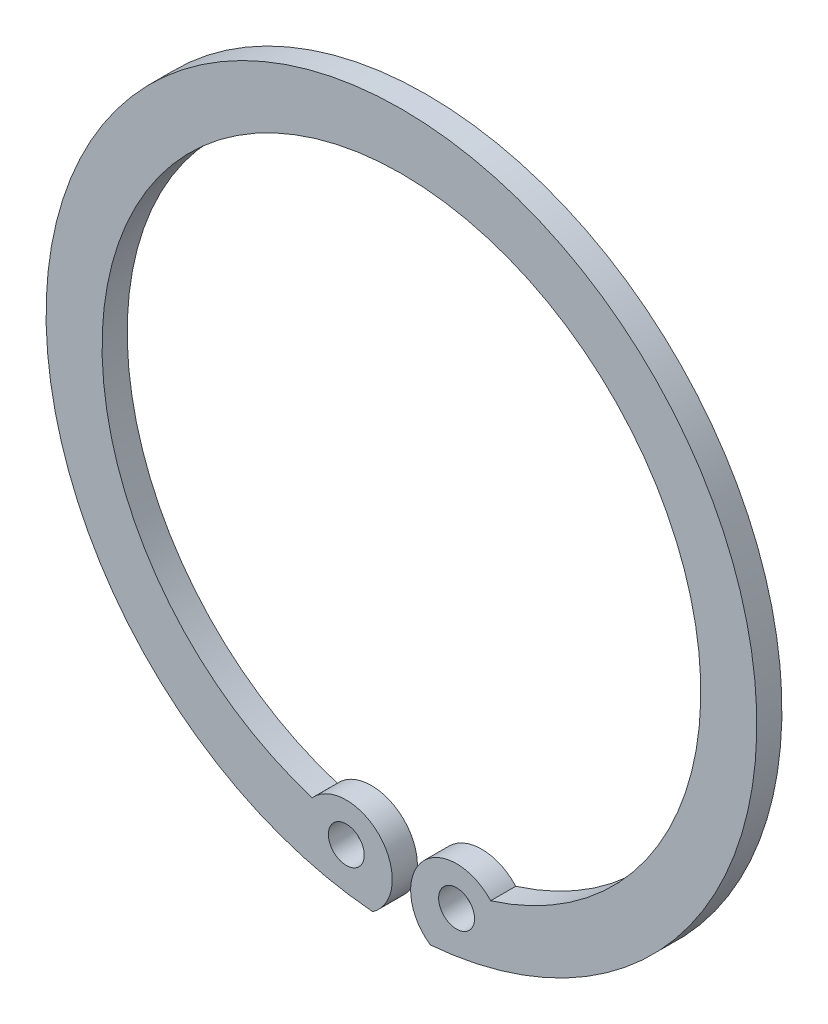
ISO-10303-21;
HEADER;
FILE_DESCRIPTION(('STEP AP214'),'2;1');
FILE_NAME('part.step','',(''),(''),'','','');
FILE_SCHEMA(('AUTOMOTIVE_DESIGN { 1 0 10303 214 1 1 1 1 }'));
ENDSEC;
DATA;
#1=APPLICATION_CONTEXT('core data for automotive mechanical design processes');
#2=APPLICATION_PROTOCOL_DEFINITION('international standard','automotive_design',2000,#1);
#3=PRODUCT_CONTEXT('',#1,'mechanical');
#4=PRODUCT('Part','Part','',(#3));
#5=PRODUCT_RELATED_PRODUCT_CATEGORY('part','',(#4));
#6=PRODUCT_DEFINITION_FORMATION('','',#4);
#7=PRODUCT_DEFINITION_CONTEXT('part definition',#1,'design');
#8=PRODUCT_DEFINITION('design','',#6,#7);
#9=PRODUCT_DEFINITION_SHAPE('','',#8);
#10=(LENGTH_UNIT() NAMED_UNIT(*) SI_UNIT(.MILLI.,.METRE.));
#11=(NAMED_UNIT(*) PLANE_ANGLE_UNIT() SI_UNIT($,.RADIAN.));
#12=(NAMED_UNIT(*) SI_UNIT($,.STERADIAN.) SOLID_ANGLE_UNIT());
#13=UNCERTAINTY_MEASURE_WITH_UNIT(LENGTH_MEASURE(1.E-05),#10,'distance_accuracy_value','');
#14=(GEOMETRIC_REPRESENTATION_CONTEXT(3) GLOBAL_UNCERTAINTY_ASSIGNED_CONTEXT((#13)) GLOBAL_UNIT_ASSIGNED_CONTEXT((#10,
#11,#12)) REPRESENTATION_CONTEXT('',''));
#15=CARTESIAN_POINT('',(0.,0.,0.));
#16=DIRECTION('',(0.,0.,1.));
#17=DIRECTION('',(1.,0.,0.));
#18=AXIS2_PLACEMENT_3D('',#15,#16,#17);
#19=CARTESIAN_POINT('',(0.,0.,1.75));
#20=DIRECTION('',(0.,0.,1.));
#21=DIRECTION('',(1.,0.,0.));
#22=AXIS2_PLACEMENT_3D('',#19,#20,#21);
#23=PLANE('',#22);
#24=CARTESIAN_POINT('',(0.,0.,1.75));
#25=DIRECTION('',(0.,0.,-1.));
#26=DIRECTION('',(1.,0.,0.));
#27=AXIS2_PLACEMENT_3D('',#24,#25,#26);
#28=CIRCLE('',#27,20.85);
#29=CARTESIAN_POINT('',(-6.21273201526708,-19.9028756943934,1.75));
#30=VERTEX_POINT('',#29);
#31=CARTESIAN_POINT('',(6.21273201526708,-19.9028756943934,1.75));
#32=VERTEX_POINT('',#31);
#33=EDGE_CURVE('E98',#30,#32,#28,.T.);
#34=ORIENTED_EDGE('',*,*,#33,.T.);
#35=CARTESIAN_POINT('',(3.84,-22.05,1.75));
#36=DIRECTION('',(0.,0.,1.));
#37=DIRECTION('',(-1.,0.,0.));
#38=AXIS2_PLACEMENT_3D('',#35,#36,#37);
#39=CIRCLE('',#38,3.2);
#40=CARTESIAN_POINT('',(2.00123624982443,-24.6689593106881,1.75));
#41=VERTEX_POINT('',#40);
#42=EDGE_CURVE('E70',#32,#41,#39,.T.);
#43=ORIENTED_EDGE('',*,*,#42,.T.);
#44=CARTESIAN_POINT('',(0.,0.,1.75));
#45=DIRECTION('',(0.,0.,-1.));
#46=DIRECTION('',(1.,0.,0.));
#47=AXIS2_PLACEMENT_3D('',#44,#45,#46);
#48=CIRCLE('',#47,24.75);
#49=CARTESIAN_POINT('',(-2.00123624982443,-24.6689593106881,1.75));
#50=VERTEX_POINT('',#49);
#51=EDGE_CURVE('E11',#50,#41,#48,.T.);
#52=ORIENTED_EDGE('',*,*,#51,.F.);
#53=CARTESIAN_POINT('',(-3.84,-22.05,1.75));
#54=DIRECTION('',(0.,0.,1.));
#55=DIRECTION('',(1.,0.,0.));
#56=AXIS2_PLACEMENT_3D('',#53,#54,#55);
#57=CIRCLE('',#56,3.2);
#58=EDGE_CURVE('E84',#50,#30,#57,.T.);
#59=ORIENTED_EDGE('',*,*,#58,.T.);
#60=EDGE_LOOP('',(#34,#43,#52,#59));
#61=FACE_BOUND('',#60,.T.);
#62=CARTESIAN_POINT('',(-3.84,-21.55,1.75));
#63=DIRECTION('',(0.,0.,-1.));
#64=DIRECTION('',(1.,0.,0.));
#65=AXIS2_PLACEMENT_3D('',#62,#63,#64);
#66=CIRCLE('',#65,1.25);
#67=CARTESIAN_POINT('',(-5.09,-21.55,1.75));
#68=VERTEX_POINT('',#67);
#69=EDGE_CURVE('E87',#68,#68,#66,.T.);
#70=ORIENTED_EDGE('',*,*,#69,.T.);
#71=EDGE_LOOP('',(#70));
#72=FACE_BOUND('',#71,.T.);
#73=CARTESIAN_POINT('',(3.84,-21.55,1.75));
#74=DIRECTION('',(0.,0.,-1.));
#75=DIRECTION('',(1.,0.,0.));
#76=AXIS2_PLACEMENT_3D('',#73,#74,#75);
#77=CIRCLE('',#76,1.25);
#78=CARTESIAN_POINT('',(2.59,-21.55,1.75));
#79=VERTEX_POINT('',#78);
#80=EDGE_CURVE('E95',#79,#79,#77,.T.);
#81=ORIENTED_EDGE('',*,*,#80,.T.);
#82=EDGE_LOOP('',(#81));
#83=FACE_BOUND('',#82,.T.);
#84=ADVANCED_FACE('F16',(#61,#72,#83),#23,.T.);
#85=CARTESIAN_POINT('',(0.,0.,0.875));
#86=DIRECTION('',(0.,0.,-1.));
#87=DIRECTION('',(1.,0.,0.));
#88=AXIS2_PLACEMENT_3D('',#85,#86,#87);
#89=CYLINDRICAL_SURFACE('',#88,24.75);
#90=ORIENTED_EDGE('',*,*,#51,.T.);
#91=DIRECTION('',(0.,0.,-1.));
#92=VECTOR('',#91,1.);
#93=CARTESIAN_POINT('',(2.00123624982443,-24.6689593106881,0.875));
#94=LINE('',#93,#92);
#95=CARTESIAN_POINT('',(2.00123624982443,-24.6689593106881,0.));
#96=VERTEX_POINT('',#95);
#97=EDGE_CURVE('E72',#41,#96,#94,.T.);
#98=ORIENTED_EDGE('',*,*,#97,.T.);
#99=CARTESIAN_POINT('',(0.,0.,0.));
#100=DIRECTION('',(0.,0.,1.));
#101=DIRECTION('',(-1.,0.,0.));
#102=AXIS2_PLACEMENT_3D('',#99,#100,#101);
#103=CIRCLE('',#102,24.75);
#104=CARTESIAN_POINT('',(-2.00123624982443,-24.6689593106881,0.));
#105=VERTEX_POINT('',#104);
#106=EDGE_CURVE('E20',#96,#105,#103,.T.);
#107=ORIENTED_EDGE('',*,*,#106,.T.);
#108=DIRECTION('',(0.,0.,1.));
#109=VECTOR('',#108,1.);
#110=CARTESIAN_POINT('',(-2.00123624982443,-24.6689593106881,0.875));
#111=LINE('',#110,#109);
#112=EDGE_CURVE('E26',#105,#50,#111,.T.);
#113=ORIENTED_EDGE('',*,*,#112,.T.);
#114=EDGE_LOOP('',(#90,#98,#107,#113));
#115=FACE_BOUND('',#114,.T.);
#116=ADVANCED_FACE('F73',(#115),#89,.T.);
#117=CARTESIAN_POINT('',(-3.84,-22.05,0.875));
#118=DIRECTION('',(0.,0.,-1.));
#119=DIRECTION('',(1.,0.,0.));
#120=AXIS2_PLACEMENT_3D('',#117,#118,#119);
#121=CYLINDRICAL_SURFACE('',#120,3.2);
#122=DIRECTION('',(0.,0.,-1.));
#123=VECTOR('',#122,1.);
#124=CARTESIAN_POINT('',(-6.21273201526708,-19.9028756943934,0.875));
#125=LINE('',#124,#123);
#126=CARTESIAN_POINT('',(-6.21273201526708,-19.9028756943934,0.));
#127=VERTEX_POINT('',#126);
#128=EDGE_CURVE('E105',#30,#127,#125,.T.);
#129=ORIENTED_EDGE('',*,*,#128,.F.);
#130=ORIENTED_EDGE('',*,*,#58,.F.);
#131=ORIENTED_EDGE('',*,*,#112,.F.);
#132=CARTESIAN_POINT('',(-3.84,-22.05,0.));
#133=DIRECTION('',(0.,0.,-1.));
#134=DIRECTION('',(1.,0.,0.));
#135=AXIS2_PLACEMENT_3D('',#132,#133,#134);
#136=CIRCLE('',#135,3.2);
#137=EDGE_CURVE('E67',#127,#105,#136,.T.);
#138=ORIENTED_EDGE('',*,*,#137,.F.);
#139=EDGE_LOOP('',(#129,#130,#131,#138));
#140=FACE_BOUND('',#139,.T.);
#141=ADVANCED_FACE('F108',(#140),#121,.T.);
#142=CARTESIAN_POINT('',(0.,0.,-1.75));
#143=DIRECTION('',(0.,0.,-1.));
#144=DIRECTION('',(1.,0.,0.));
#145=AXIS2_PLACEMENT_3D('',#142,#143,#144);
#146=CYLINDRICAL_SURFACE('',#145,20.85);
#147=DIRECTION('',(0.,0.,1.));
#148=VECTOR('',#147,1.);
#149=CARTESIAN_POINT('',(6.21273201526708,-19.9028756943934,0.875));
#150=LINE('',#149,#148);
#151=CARTESIAN_POINT('',(6.21273201526708,-19.9028756943934,0.));
#152=VERTEX_POINT('',#151);
#153=EDGE_CURVE('E79',#152,#32,#150,.T.);
#154=ORIENTED_EDGE('',*,*,#153,.T.);
#155=ORIENTED_EDGE('',*,*,#33,.F.);
#156=ORIENTED_EDGE('',*,*,#128,.T.);
#157=CARTESIAN_POINT('',(0.,0.,0.));
#158=DIRECTION('',(0.,0.,1.));
#159=DIRECTION('',(1.,0.,0.));
#160=AXIS2_PLACEMENT_3D('',#157,#158,#159);
#161=CIRCLE('',#160,20.85);
#162=EDGE_CURVE('E69',#152,#127,#161,.T.);
#163=ORIENTED_EDGE('',*,*,#162,.F.);
#164=EDGE_LOOP('',(#154,#155,#156,#163));
#165=FACE_BOUND('',#164,.T.);
#166=ADVANCED_FACE('F18',(#165),#146,.F.);
#167=CARTESIAN_POINT('',(0.,0.,0.));
#168=DIRECTION('',(0.,0.,-1.));
#169=DIRECTION('',(-1.,0.,0.));
#170=AXIS2_PLACEMENT_3D('',#167,#168,#169);
#171=PLANE('',#170);
#172=ORIENTED_EDGE('',*,*,#106,.F.);
#173=CARTESIAN_POINT('',(3.84,-22.05,0.));
#174=DIRECTION('',(0.,0.,-1.));
#175=DIRECTION('',(-1.,0.,0.));
#176=AXIS2_PLACEMENT_3D('',#173,#174,#175);
#177=CIRCLE('',#176,3.2);
#178=EDGE_CURVE('E64',#96,#152,#177,.T.);
#179=ORIENTED_EDGE('',*,*,#178,.T.);
#180=ORIENTED_EDGE('',*,*,#162,.T.);
#181=ORIENTED_EDGE('',*,*,#137,.T.);
#182=EDGE_LOOP('',(#172,#179,#180,#181));
#183=FACE_BOUND('',#182,.T.);
#184=CARTESIAN_POINT('',(-3.84,-21.55,0.));
#185=DIRECTION('',(0.,0.,1.));
#186=DIRECTION('',(1.,0.,0.));
#187=AXIS2_PLACEMENT_3D('',#184,#185,#186);
#188=CIRCLE('',#187,1.25);
#189=CARTESIAN_POINT('',(-5.09,-21.55,0.));
#190=VERTEX_POINT('',#189);
#191=EDGE_CURVE('E81',#190,#190,#188,.T.);
#192=ORIENTED_EDGE('',*,*,#191,.T.);
#193=EDGE_LOOP('',(#192));
#194=FACE_BOUND('',#193,.T.);
#195=CARTESIAN_POINT('',(3.84,-21.55,0.));
#196=DIRECTION('',(0.,0.,1.));
#197=DIRECTION('',(1.,0.,0.));
#198=AXIS2_PLACEMENT_3D('',#195,#196,#197);
#199=CIRCLE('',#198,1.25);
#200=CARTESIAN_POINT('',(2.59,-21.55,0.));
#201=VERTEX_POINT('',#200);
#202=EDGE_CURVE('E89',#201,#201,#199,.T.);
#203=ORIENTED_EDGE('',*,*,#202,.T.);
#204=EDGE_LOOP('',(#203));
#205=FACE_BOUND('',#204,.T.);
#206=ADVANCED_FACE('F60',(#183,#194,#205),#171,.T.);
#207=CARTESIAN_POINT('',(3.84,-22.05,0.875));
#208=DIRECTION('',(0.,0.,1.));
#209=DIRECTION('',(-1.,0.,0.));
#210=AXIS2_PLACEMENT_3D('',#207,#208,#209);
#211=CYLINDRICAL_SURFACE('',#210,3.2);
#212=ORIENTED_EDGE('',*,*,#153,.F.);
#213=ORIENTED_EDGE('',*,*,#178,.F.);
#214=ORIENTED_EDGE('',*,*,#97,.F.);
#215=ORIENTED_EDGE('',*,*,#42,.F.);
#216=EDGE_LOOP('',(#212,#213,#214,#215));
#217=FACE_BOUND('',#216,.T.);
#218=ADVANCED_FACE('F77',(#217),#211,.T.);
#219=CARTESIAN_POINT('',(-3.84,-21.55,0.875));
#220=DIRECTION('',(0.,0.,-1.));
#221=DIRECTION('',(1.,0.,0.));
#222=AXIS2_PLACEMENT_3D('',#219,#220,#221);
#223=CYLINDRICAL_SURFACE('',#222,1.25);
#224=ORIENTED_EDGE('',*,*,#191,.F.);
#225=EDGE_LOOP('',(#224));
#226=FACE_BOUND('',#225,.T.);
#227=ORIENTED_EDGE('',*,*,#69,.F.);
#228=EDGE_LOOP('',(#227));
#229=FACE_BOUND('',#228,.T.);
#230=ADVANCED_FACE('F120',(#226,#229),#223,.F.);
#231=CARTESIAN_POINT('',(3.84,-21.55,0.875));
#232=DIRECTION('',(0.,0.,-1.));
#233=DIRECTION('',(1.,0.,0.));
#234=AXIS2_PLACEMENT_3D('',#231,#232,#233);
#235=CYLINDRICAL_SURFACE('',#234,1.25);
#236=ORIENTED_EDGE('',*,*,#202,.F.);
#237=EDGE_LOOP('',(#236));
#238=FACE_BOUND('',#237,.T.);
#239=ORIENTED_EDGE('',*,*,#80,.F.);
#240=EDGE_LOOP('',(#239));
#241=FACE_BOUND('',#240,.T.);
#242=ADVANCED_FACE('F118',(#238,#241),#235,.F.);
#243=CLOSED_SHELL('',(#84,#116,#141,#166,#206,#218,#230,#242));
#244=MANIFOLD_SOLID_BREP('B1',#243);
#245=ADVANCED_BREP_SHAPE_REPRESENTATION('',(#18,#244),#14);
#246=SHAPE_DEFINITION_REPRESENTATION(#9,#245);
ENDSEC;
END-ISO-10303-21;
